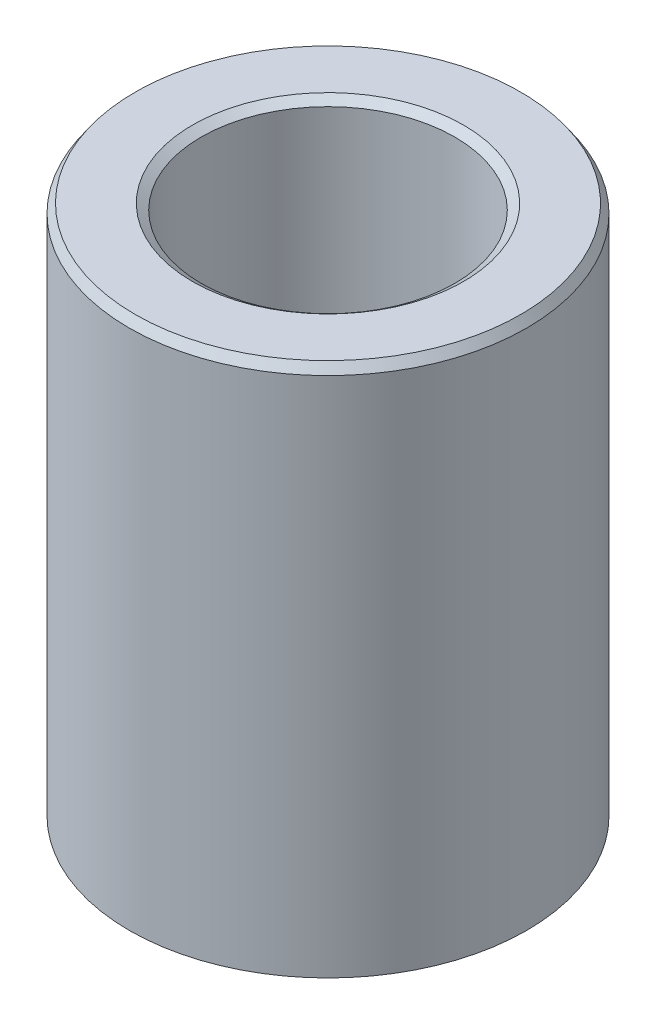
ISO-10303-21;
HEADER;
FILE_DESCRIPTION(('STEP AP214'),'2;1');
FILE_NAME('part.step','',(''),(''),'','','');
FILE_SCHEMA(('AUTOMOTIVE_DESIGN { 1 0 10303 214 1 1 1 1 }'));
ENDSEC;
DATA;
#1=APPLICATION_CONTEXT('core data for automotive mechanical design processes');
#2=APPLICATION_PROTOCOL_DEFINITION('international standard','automotive_design',2000,#1);
#3=PRODUCT_CONTEXT('',#1,'mechanical');
#4=PRODUCT('Part','Part','',(#3));
#5=PRODUCT_RELATED_PRODUCT_CATEGORY('part','',(#4));
#6=PRODUCT_DEFINITION_FORMATION('','',#4);
#7=PRODUCT_DEFINITION_CONTEXT('part definition',#1,'design');
#8=PRODUCT_DEFINITION('design','',#6,#7);
#9=PRODUCT_DEFINITION_SHAPE('','',#8);
#10=(LENGTH_UNIT() NAMED_UNIT(*) SI_UNIT(.MILLI.,.METRE.));
#11=(NAMED_UNIT(*) PLANE_ANGLE_UNIT() SI_UNIT($,.RADIAN.));
#12=(NAMED_UNIT(*) SI_UNIT($,.STERADIAN.) SOLID_ANGLE_UNIT());
#13=UNCERTAINTY_MEASURE_WITH_UNIT(LENGTH_MEASURE(1.E-05),#10,'distance_accuracy_value','');
#14=(GEOMETRIC_REPRESENTATION_CONTEXT(3) GLOBAL_UNCERTAINTY_ASSIGNED_CONTEXT((#13)) GLOBAL_UNIT_ASSIGNED_CONTEXT((#10,
#11,#12)) REPRESENTATION_CONTEXT('',''));
#15=CARTESIAN_POINT('',(0.,0.,0.));
#16=DIRECTION('',(0.,0.,1.));
#17=DIRECTION('',(1.,0.,0.));
#18=AXIS2_PLACEMENT_3D('',#15,#16,#17);
#19=CARTESIAN_POINT('',(0.,128.229420017173,0.));
#20=DIRECTION('',(0.,-1.,0.));
#21=DIRECTION('',(0.,0.,-1.));
#22=AXIS2_PLACEMENT_3D('',#19,#20,#21);
#23=CYLINDRICAL_SURFACE('',#22,47.5);
#24=CARTESIAN_POINT('',(0.,1.42953408532565,0.));
#25=DIRECTION('',(0.,1.,0.));
#26=DIRECTION('',(0.,0.,1.));
#27=AXIS2_PLACEMENT_3D('',#24,#25,#26);
#28=CIRCLE('',#27,47.5);
#29=CARTESIAN_POINT('',(0.,1.42953408532565,47.5));
#30=VERTEX_POINT('',#29);
#31=EDGE_CURVE('E10',#30,#30,#28,.T.);
#32=ORIENTED_EDGE('',*,*,#31,.T.);
#33=EDGE_LOOP('',(#32));
#34=FACE_BOUND('',#33,.T.);
#35=CARTESIAN_POINT('',(0.,126.138484509975,0.));
#36=DIRECTION('',(0.,1.,0.));
#37=DIRECTION('',(0.,0.,1.));
#38=AXIS2_PLACEMENT_3D('',#35,#36,#37);
#39=CIRCLE('',#38,47.5);
#40=CARTESIAN_POINT('',(0.,126.138484509975,47.5));
#41=VERTEX_POINT('',#40);
#42=EDGE_CURVE('E50',#41,#41,#39,.F.);
#43=ORIENTED_EDGE('',*,*,#42,.T.);
#44=EDGE_LOOP('',(#43));
#45=FACE_BOUND('',#44,.T.);
#46=ADVANCED_FACE('F39',(#34,#45),#23,.T.);
#47=CARTESIAN_POINT('',(0.,128.229420017173,0.));
#48=DIRECTION('',(0.,1.,0.));
#49=DIRECTION('',(0.,0.,1.));
#50=AXIS2_PLACEMENT_3D('',#47,#48,#49);
#51=PLANE('',#50);
#52=CARTESIAN_POINT('',(0.,128.229420017173,0.));
#53=DIRECTION('',(0.,1.,0.));
#54=DIRECTION('',(0.,0.,1.));
#55=AXIS2_PLACEMENT_3D('',#52,#53,#54);
#56=CIRCLE('',#55,32.4056503409707);
#57=CARTESIAN_POINT('',(0.,128.229420017173,32.4056503409707));
#58=VERTEX_POINT('',#57);
#59=EDGE_CURVE('E58',#58,#58,#56,.F.);
#60=ORIENTED_EDGE('',*,*,#59,.T.);
#61=EDGE_LOOP('',(#60));
#62=FACE_BOUND('',#61,.T.);
#63=CARTESIAN_POINT('',(0.,128.229420017173,0.));
#64=DIRECTION('',(0.,1.,0.));
#65=DIRECTION('',(0.,0.,1.));
#66=AXIS2_PLACEMENT_3D('',#63,#64,#65);
#67=CIRCLE('',#66,46.0704659146744);
#68=CARTESIAN_POINT('',(0.,128.229420017173,46.0704659146744));
#69=VERTEX_POINT('',#68);
#70=EDGE_CURVE('E61',#69,#69,#67,.T.);
#71=ORIENTED_EDGE('',*,*,#70,.T.);
#72=EDGE_LOOP('',(#71));
#73=FACE_BOUND('',#72,.T.);
#74=ADVANCED_FACE('F88',(#62,#73),#51,.T.);
#75=CARTESIAN_POINT('',(0.,0.,0.));
#76=DIRECTION('',(0.,1.,0.));
#77=DIRECTION('',(0.,0.,1.));
#78=AXIS2_PLACEMENT_3D('',#75,#76,#77);
#79=PLANE('',#78);
#80=CARTESIAN_POINT('',(0.,0.,0.));
#81=DIRECTION('',(0.,1.,0.));
#82=DIRECTION('',(0.,0.,1.));
#83=AXIS2_PLACEMENT_3D('',#80,#81,#82);
#84=CIRCLE('',#83,31.744248919098);
#85=CARTESIAN_POINT('',(0.,0.,31.744248919098));
#86=VERTEX_POINT('',#85);
#87=EDGE_CURVE('E51',#86,#86,#84,.T.);
#88=ORIENTED_EDGE('',*,*,#87,.T.);
#89=EDGE_LOOP('',(#88));
#90=FACE_BOUND('',#89,.T.);
#91=CARTESIAN_POINT('',(0.,0.,0.));
#92=DIRECTION('',(0.,1.,0.));
#93=DIRECTION('',(0.,0.,1.));
#94=AXIS2_PLACEMENT_3D('',#91,#92,#93);
#95=CIRCLE('',#94,45.4090644928016);
#96=CARTESIAN_POINT('',(0.,0.,45.4090644928016));
#97=VERTEX_POINT('',#96);
#98=EDGE_CURVE('E54',#97,#97,#95,.F.);
#99=ORIENTED_EDGE('',*,*,#98,.T.);
#100=EDGE_LOOP('',(#99));
#101=FACE_BOUND('',#100,.T.);
#102=ADVANCED_FACE('F83',(#90,#101),#79,.F.);
#103=CARTESIAN_POINT('',(0.,128.229420017173,0.));
#104=DIRECTION('',(0.,-1.,0.));
#105=DIRECTION('',(0.,0.,-1.));
#106=AXIS2_PLACEMENT_3D('',#103,#104,#105);
#107=CYLINDRICAL_SURFACE('',#106,30.3147148337724);
#108=CARTESIAN_POINT('',(0.,126.799885931848,0.));
#109=DIRECTION('',(0.,1.,0.));
#110=DIRECTION('',(0.,0.,1.));
#111=AXIS2_PLACEMENT_3D('',#108,#109,#110);
#112=CIRCLE('',#111,30.3147148337724);
#113=CARTESIAN_POINT('',(0.,126.799885931848,30.3147148337724));
#114=VERTEX_POINT('',#113);
#115=EDGE_CURVE('E67',#114,#114,#112,.T.);
#116=ORIENTED_EDGE('',*,*,#115,.T.);
#117=EDGE_LOOP('',(#116));
#118=FACE_BOUND('',#117,.T.);
#119=CARTESIAN_POINT('',(0.,2.09093550719835,0.));
#120=DIRECTION('',(0.,1.,0.));
#121=DIRECTION('',(0.,0.,1.));
#122=AXIS2_PLACEMENT_3D('',#119,#120,#121);
#123=CIRCLE('',#122,30.3147148337724);
#124=CARTESIAN_POINT('',(0.,2.09093550719835,30.3147148337724));
#125=VERTEX_POINT('',#124);
#126=EDGE_CURVE('E69',#125,#125,#123,.F.);
#127=ORIENTED_EDGE('',*,*,#126,.T.);
#128=EDGE_LOOP('',(#127));
#129=FACE_BOUND('',#128,.T.);
#130=ADVANCED_FACE('F71',(#118,#129),#107,.F.);
#131=CARTESIAN_POINT('',(0.,126.799885931848,0.));
#132=DIRECTION('',(0.,1.,0.));
#133=DIRECTION('',(0.,0.,1.));
#134=AXIS2_PLACEMENT_3D('',#131,#132,#133);
#135=CONICAL_SURFACE('',#134,30.3147148337724,0.97110648644155);
#136=ORIENTED_EDGE('',*,*,#59,.F.);
#137=EDGE_LOOP('',(#136));
#138=FACE_BOUND('',#137,.T.);
#139=ORIENTED_EDGE('',*,*,#115,.F.);
#140=EDGE_LOOP('',(#139));
#141=FACE_BOUND('',#140,.T.);
#142=ADVANCED_FACE('F77',(#138,#141),#135,.F.);
#143=CARTESIAN_POINT('',(0.,0.,0.));
#144=DIRECTION('',(0.,-1.,0.));
#145=DIRECTION('',(0.,0.,-1.));
#146=AXIS2_PLACEMENT_3D('',#143,#144,#145);
#147=CONICAL_SURFACE('',#146,31.744248919098,0.599689840353342);
#148=ORIENTED_EDGE('',*,*,#126,.F.);
#149=EDGE_LOOP('',(#148));
#150=FACE_BOUND('',#149,.T.);
#151=ORIENTED_EDGE('',*,*,#87,.F.);
#152=EDGE_LOOP('',(#151));
#153=FACE_BOUND('',#152,.T.);
#154=ADVANCED_FACE('F73',(#150,#153),#147,.F.);
#155=CARTESIAN_POINT('',(0.,1.42953408532565,0.));
#156=DIRECTION('',(0.,1.,0.));
#157=DIRECTION('',(0.,0.,1.));
#158=AXIS2_PLACEMENT_3D('',#155,#156,#157);
#159=CONICAL_SURFACE('',#158,47.5,0.971106486441549);
#160=ORIENTED_EDGE('',*,*,#98,.F.);
#161=EDGE_LOOP('',(#160));
#162=FACE_BOUND('',#161,.T.);
#163=ORIENTED_EDGE('',*,*,#31,.F.);
#164=EDGE_LOOP('',(#163));
#165=FACE_BOUND('',#164,.T.);
#166=ADVANCED_FACE('F76',(#162,#165),#159,.T.);
#167=CARTESIAN_POINT('',(0.,128.229420017173,0.));
#168=DIRECTION('',(0.,-1.,0.));
#169=DIRECTION('',(0.,0.,-1.));
#170=AXIS2_PLACEMENT_3D('',#167,#168,#169);
#171=CONICAL_SURFACE('',#170,46.0704659146744,0.599689840353344);
#172=ORIENTED_EDGE('',*,*,#42,.F.);
#173=EDGE_LOOP('',(#172));
#174=FACE_BOUND('',#173,.T.);
#175=ORIENTED_EDGE('',*,*,#70,.F.);
#176=EDGE_LOOP('',(#175));
#177=FACE_BOUND('',#176,.T.);
#178=ADVANCED_FACE('F45',(#174,#177),#171,.T.);
#179=CLOSED_SHELL('',(#46,#74,#102,#130,#142,#154,#166,#178));
#180=MANIFOLD_SOLID_BREP('B2',#179);
#181=ADVANCED_BREP_SHAPE_REPRESENTATION('',(#18,#180),#14);
#182=SHAPE_DEFINITION_REPRESENTATION(#9,#181);
ENDSEC;
END-ISO-10303-21;
